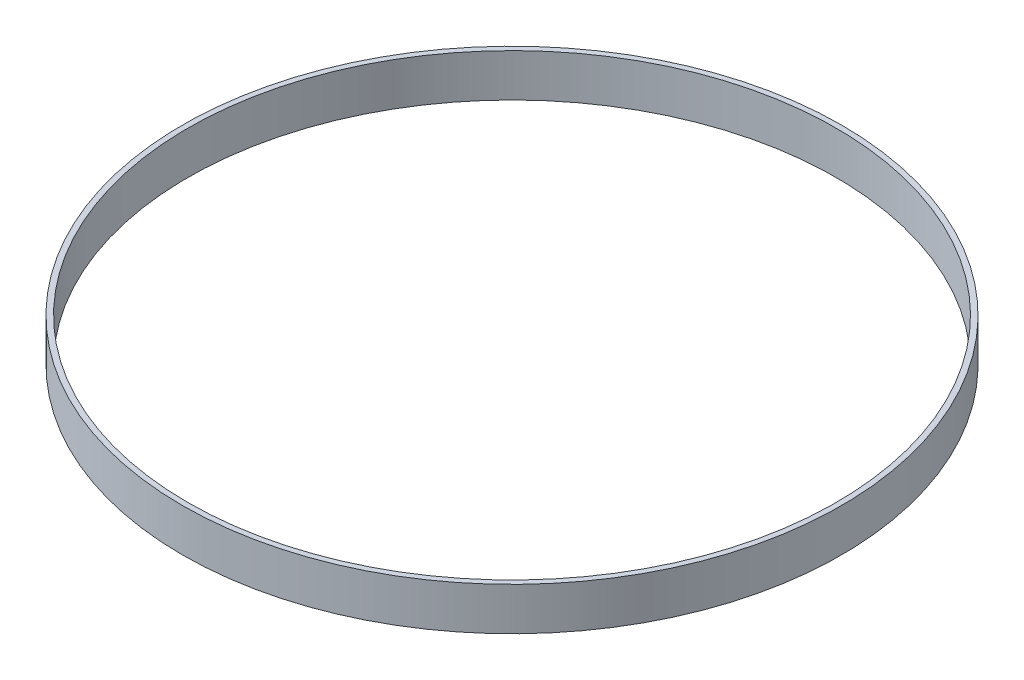
ISO-10303-21;
HEADER;
FILE_DESCRIPTION(('STEP AP214'),'2;1');
FILE_NAME('part.step','',(''),(''),'','','');
FILE_SCHEMA(('AUTOMOTIVE_DESIGN { 1 0 10303 214 1 1 1 1 }'));
ENDSEC;
DATA;
#1=APPLICATION_CONTEXT('core data for automotive mechanical design processes');
#2=APPLICATION_PROTOCOL_DEFINITION('international standard','automotive_design',2000,#1);
#3=PRODUCT_CONTEXT('',#1,'mechanical');
#4=PRODUCT('Part','Part','',(#3));
#5=PRODUCT_RELATED_PRODUCT_CATEGORY('part','',(#4));
#6=PRODUCT_DEFINITION_FORMATION('','',#4);
#7=PRODUCT_DEFINITION_CONTEXT('part definition',#1,'design');
#8=PRODUCT_DEFINITION('design','',#6,#7);
#9=PRODUCT_DEFINITION_SHAPE('','',#8);
#10=(LENGTH_UNIT() NAMED_UNIT(*) SI_UNIT(.MILLI.,.METRE.));
#11=(NAMED_UNIT(*) PLANE_ANGLE_UNIT() SI_UNIT($,.RADIAN.));
#12=(NAMED_UNIT(*) SI_UNIT($,.STERADIAN.) SOLID_ANGLE_UNIT());
#13=UNCERTAINTY_MEASURE_WITH_UNIT(LENGTH_MEASURE(1.E-05),#10,'distance_accuracy_value','');
#14=(GEOMETRIC_REPRESENTATION_CONTEXT(3) GLOBAL_UNCERTAINTY_ASSIGNED_CONTEXT((#13)) GLOBAL_UNIT_ASSIGNED_CONTEXT((#10,
#11,#12)) REPRESENTATION_CONTEXT('',''));
#15=CARTESIAN_POINT('',(0.,0.,0.));
#16=DIRECTION('',(0.,0.,1.));
#17=DIRECTION('',(1.,0.,0.));
#18=AXIS2_PLACEMENT_3D('',#15,#16,#17);
#19=CARTESIAN_POINT('',(0.,12.7,0.));
#20=DIRECTION('',(0.,1.,0.));
#21=DIRECTION('',(0.,0.,1.));
#22=AXIS2_PLACEMENT_3D('',#19,#20,#21);
#23=PLANE('',#22);
#24=CARTESIAN_POINT('',(0.,12.7,0.));
#25=DIRECTION('',(0.,1.,0.));
#26=DIRECTION('',(0.,0.,1.));
#27=AXIS2_PLACEMENT_3D('',#24,#25,#26);
#28=CIRCLE('',#27,97.79);
#29=CARTESIAN_POINT('',(0.,12.7,97.79));
#30=VERTEX_POINT('',#29);
#31=EDGE_CURVE('E10',#30,#30,#28,.T.);
#32=ORIENTED_EDGE('',*,*,#31,.T.);
#33=EDGE_LOOP('',(#32));
#34=FACE_BOUND('',#33,.T.);
#35=CARTESIAN_POINT('',(0.,12.7,0.));
#36=DIRECTION('',(0.,1.,0.));
#37=DIRECTION('',(0.,0.,1.));
#38=AXIS2_PLACEMENT_3D('',#35,#36,#37);
#39=CIRCLE('',#38,96.2025);
#40=CARTESIAN_POINT('',(0.,12.7,96.2025));
#41=VERTEX_POINT('',#40);
#42=EDGE_CURVE('E50',#41,#41,#39,.T.);
#43=ORIENTED_EDGE('',*,*,#42,.F.);
#44=EDGE_LOOP('',(#43));
#45=FACE_BOUND('',#44,.T.);
#46=ADVANCED_FACE('F37',(#34,#45),#23,.T.);
#47=CARTESIAN_POINT('',(0.,0.,0.));
#48=DIRECTION('',(0.,1.,0.));
#49=DIRECTION('',(0.,0.,1.));
#50=AXIS2_PLACEMENT_3D('',#47,#48,#49);
#51=PLANE('',#50);
#52=CARTESIAN_POINT('',(0.,0.,0.));
#53=DIRECTION('',(0.,1.,0.));
#54=DIRECTION('',(0.,0.,1.));
#55=AXIS2_PLACEMENT_3D('',#52,#53,#54);
#56=CIRCLE('',#55,97.79);
#57=CARTESIAN_POINT('',(0.,0.,97.79));
#58=VERTEX_POINT('',#57);
#59=EDGE_CURVE('E41',#58,#58,#56,.T.);
#60=ORIENTED_EDGE('',*,*,#59,.F.);
#61=EDGE_LOOP('',(#60));
#62=FACE_BOUND('',#61,.T.);
#63=CARTESIAN_POINT('',(0.,0.,0.));
#64=DIRECTION('',(0.,1.,0.));
#65=DIRECTION('',(0.,0.,1.));
#66=AXIS2_PLACEMENT_3D('',#63,#64,#65);
#67=CIRCLE('',#66,96.2025);
#68=CARTESIAN_POINT('',(0.,0.,96.2025));
#69=VERTEX_POINT('',#68);
#70=EDGE_CURVE('E52',#69,#69,#67,.T.);
#71=ORIENTED_EDGE('',*,*,#70,.T.);
#72=EDGE_LOOP('',(#71));
#73=FACE_BOUND('',#72,.T.);
#74=ADVANCED_FACE('F64',(#62,#73),#51,.F.);
#75=CARTESIAN_POINT('',(0.,12.7,0.));
#76=DIRECTION('',(0.,-1.,0.));
#77=DIRECTION('',(0.,0.,-1.));
#78=AXIS2_PLACEMENT_3D('',#75,#76,#77);
#79=CYLINDRICAL_SURFACE('',#78,97.79);
#80=ORIENTED_EDGE('',*,*,#31,.F.);
#81=EDGE_LOOP('',(#80));
#82=FACE_BOUND('',#81,.T.);
#83=ORIENTED_EDGE('',*,*,#59,.T.);
#84=EDGE_LOOP('',(#83));
#85=FACE_BOUND('',#84,.T.);
#86=ADVANCED_FACE('F39',(#82,#85),#79,.T.);
#87=CARTESIAN_POINT('',(0.,12.7,0.));
#88=DIRECTION('',(0.,-1.,0.));
#89=DIRECTION('',(0.,0.,-1.));
#90=AXIS2_PLACEMENT_3D('',#87,#88,#89);
#91=CYLINDRICAL_SURFACE('',#90,96.2025);
#92=ORIENTED_EDGE('',*,*,#42,.T.);
#93=EDGE_LOOP('',(#92));
#94=FACE_BOUND('',#93,.T.);
#95=ORIENTED_EDGE('',*,*,#70,.F.);
#96=EDGE_LOOP('',(#95));
#97=FACE_BOUND('',#96,.T.);
#98=ADVANCED_FACE('F60',(#94,#97),#91,.F.);
#99=CLOSED_SHELL('',(#46,#74,#86,#98));
#100=MANIFOLD_SOLID_BREP('B2',#99);
#101=ADVANCED_BREP_SHAPE_REPRESENTATION('',(#18,#100),#14);
#102=SHAPE_DEFINITION_REPRESENTATION(#9,#101);
ENDSEC;
END-ISO-10303-21;
